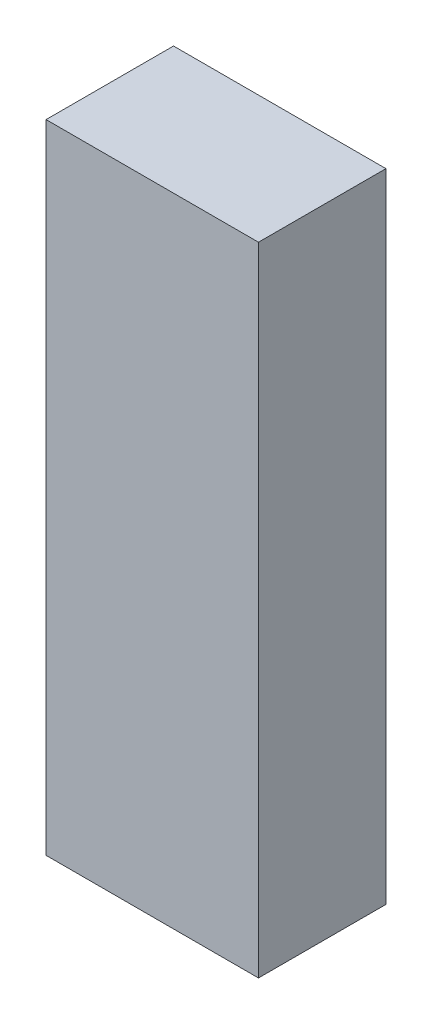
ISO-10303-21;
HEADER;
FILE_DESCRIPTION(('STEP AP214'),'2;1');
FILE_NAME('part.step','',(''),(''),'','','');
FILE_SCHEMA(('AUTOMOTIVE_DESIGN { 1 0 10303 214 1 1 1 1 }'));
ENDSEC;
DATA;
#1=APPLICATION_CONTEXT('core data for automotive mechanical design processes');
#2=APPLICATION_PROTOCOL_DEFINITION('international standard','automotive_design',2000,#1);
#3=PRODUCT_CONTEXT('',#1,'mechanical');
#4=PRODUCT('Part','Part','',(#3));
#5=PRODUCT_RELATED_PRODUCT_CATEGORY('part','',(#4));
#6=PRODUCT_DEFINITION_FORMATION('','',#4);
#7=PRODUCT_DEFINITION_CONTEXT('part definition',#1,'design');
#8=PRODUCT_DEFINITION('design','',#6,#7);
#9=PRODUCT_DEFINITION_SHAPE('','',#8);
#10=(LENGTH_UNIT() NAMED_UNIT(*) SI_UNIT(.MILLI.,.METRE.));
#11=(NAMED_UNIT(*) PLANE_ANGLE_UNIT() SI_UNIT($,.RADIAN.));
#12=(NAMED_UNIT(*) SI_UNIT($,.STERADIAN.) SOLID_ANGLE_UNIT());
#13=UNCERTAINTY_MEASURE_WITH_UNIT(LENGTH_MEASURE(1.E-05),#10,'distance_accuracy_value','');
#14=(GEOMETRIC_REPRESENTATION_CONTEXT(3) GLOBAL_UNCERTAINTY_ASSIGNED_CONTEXT((#13)) GLOBAL_UNIT_ASSIGNED_CONTEXT((#10,
#11,#12)) REPRESENTATION_CONTEXT('',''));
#15=CARTESIAN_POINT('',(0.,0.,0.));
#16=DIRECTION('',(0.,0.,1.));
#17=DIRECTION('',(1.,0.,0.));
#18=AXIS2_PLACEMENT_3D('',#15,#16,#17);
#19=CARTESIAN_POINT('',(-23.8023952095809,36.377245508982,30.));
#20=DIRECTION('',(1.,0.,0.));
#21=DIRECTION('',(0.,0.,-1.));
#22=AXIS2_PLACEMENT_3D('',#19,#20,#21);
#23=PLANE('',#22);
#24=DIRECTION('',(0.,-1.,0.));
#25=VECTOR('',#24,1.);
#26=CARTESIAN_POINT('',(-23.8023952095809,36.377245508982,0.));
#27=LINE('',#26,#25);
#28=CARTESIAN_POINT('',(-23.8023952095809,36.377245508982,0.));
#29=VERTEX_POINT('',#28);
#30=CARTESIAN_POINT('',(-23.8023952095809,-113.622754491018,0.));
#31=VERTEX_POINT('',#30);
#32=EDGE_CURVE('E104',#29,#31,#27,.T.);
#33=ORIENTED_EDGE('',*,*,#32,.T.);
#34=DIRECTION('',(0.,0.,-1.));
#35=VECTOR('',#34,1.);
#36=CARTESIAN_POINT('',(-23.8023952095809,-113.622754491018,30.));
#37=LINE('',#36,#35);
#38=CARTESIAN_POINT('',(-23.8023952095809,-113.622754491018,30.));
#39=VERTEX_POINT('',#38);
#40=EDGE_CURVE('E11',#39,#31,#37,.T.);
#41=ORIENTED_EDGE('',*,*,#40,.F.);
#42=DIRECTION('',(0.,-1.,0.));
#43=VECTOR('',#42,1.);
#44=CARTESIAN_POINT('',(-23.8023952095809,36.377245508982,30.));
#45=LINE('',#44,#43);
#46=CARTESIAN_POINT('',(-23.8023952095809,36.377245508982,30.));
#47=VERTEX_POINT('',#46);
#48=EDGE_CURVE('E92',#47,#39,#45,.T.);
#49=ORIENTED_EDGE('',*,*,#48,.F.);
#50=DIRECTION('',(0.,0.,-1.));
#51=VECTOR('',#50,1.);
#52=CARTESIAN_POINT('',(-23.8023952095809,36.377245508982,30.));
#53=LINE('',#52,#51);
#54=EDGE_CURVE('E100',#47,#29,#53,.T.);
#55=ORIENTED_EDGE('',*,*,#54,.T.);
#56=EDGE_LOOP('',(#33,#41,#49,#55));
#57=FACE_BOUND('',#56,.T.);
#58=ADVANCED_FACE('F41',(#57),#23,.F.);
#59=CARTESIAN_POINT('',(-23.8023952095809,-113.622754491018,30.));
#60=DIRECTION('',(0.,1.,0.));
#61=DIRECTION('',(-1.,0.,0.));
#62=AXIS2_PLACEMENT_3D('',#59,#60,#61);
#63=PLANE('',#62);
#64=DIRECTION('',(1.,0.,0.));
#65=VECTOR('',#64,1.);
#66=CARTESIAN_POINT('',(-23.8023952095809,-113.622754491018,0.));
#67=LINE('',#66,#65);
#68=CARTESIAN_POINT('',(26.1976047904191,-113.622754491018,0.));
#69=VERTEX_POINT('',#68);
#70=EDGE_CURVE('E96',#31,#69,#67,.T.);
#71=ORIENTED_EDGE('',*,*,#70,.T.);
#72=DIRECTION('',(0.,0.,-1.));
#73=VECTOR('',#72,1.);
#74=CARTESIAN_POINT('',(26.1976047904191,-113.622754491018,30.));
#75=LINE('',#74,#73);
#76=CARTESIAN_POINT('',(26.1976047904191,-113.622754491018,30.));
#77=VERTEX_POINT('',#76);
#78=EDGE_CURVE('E49',#77,#69,#75,.T.);
#79=ORIENTED_EDGE('',*,*,#78,.F.);
#80=DIRECTION('',(1.,0.,0.));
#81=VECTOR('',#80,1.);
#82=CARTESIAN_POINT('',(-23.8023952095809,-113.622754491018,30.));
#83=LINE('',#82,#81);
#84=EDGE_CURVE('E87',#39,#77,#83,.T.);
#85=ORIENTED_EDGE('',*,*,#84,.F.);
#86=ORIENTED_EDGE('',*,*,#40,.T.);
#87=EDGE_LOOP('',(#71,#79,#85,#86));
#88=FACE_BOUND('',#87,.T.);
#89=ADVANCED_FACE('F95',(#88),#63,.F.);
#90=CARTESIAN_POINT('',(26.1976047904191,36.377245508982,30.));
#91=DIRECTION('',(-1.,0.,0.));
#92=DIRECTION('',(0.,-1.,0.));
#93=AXIS2_PLACEMENT_3D('',#90,#91,#92);
#94=PLANE('',#93);
#95=DIRECTION('',(0.,1.,0.));
#96=VECTOR('',#95,1.);
#97=CARTESIAN_POINT('',(26.1976047904191,36.377245508982,0.));
#98=LINE('',#97,#96);
#99=CARTESIAN_POINT('',(26.1976047904191,36.377245508982,0.));
#100=VERTEX_POINT('',#99);
#101=EDGE_CURVE('E74',#69,#100,#98,.T.);
#102=ORIENTED_EDGE('',*,*,#101,.T.);
#103=DIRECTION('',(0.,0.,-1.));
#104=VECTOR('',#103,1.);
#105=CARTESIAN_POINT('',(26.1976047904191,36.377245508982,30.));
#106=LINE('',#105,#104);
#107=CARTESIAN_POINT('',(26.1976047904191,36.377245508982,30.));
#108=VERTEX_POINT('',#107);
#109=EDGE_CURVE('E97',#108,#100,#106,.T.);
#110=ORIENTED_EDGE('',*,*,#109,.F.);
#111=DIRECTION('',(0.,1.,0.));
#112=VECTOR('',#111,1.);
#113=CARTESIAN_POINT('',(26.1976047904191,36.377245508982,30.));
#114=LINE('',#113,#112);
#115=EDGE_CURVE('E90',#77,#108,#114,.T.);
#116=ORIENTED_EDGE('',*,*,#115,.F.);
#117=ORIENTED_EDGE('',*,*,#78,.T.);
#118=EDGE_LOOP('',(#102,#110,#116,#117));
#119=FACE_BOUND('',#118,.T.);
#120=ADVANCED_FACE('F98',(#119),#94,.F.);
#121=CARTESIAN_POINT('',(-23.8023952095809,36.377245508982,30.));
#122=DIRECTION('',(0.,-1.,0.));
#123=DIRECTION('',(0.,0.,-1.));
#124=AXIS2_PLACEMENT_3D('',#121,#122,#123);
#125=PLANE('',#124);
#126=DIRECTION('',(-1.,0.,0.));
#127=VECTOR('',#126,1.);
#128=CARTESIAN_POINT('',(-23.8023952095809,36.377245508982,0.));
#129=LINE('',#128,#127);
#130=EDGE_CURVE('E80',#100,#29,#129,.T.);
#131=ORIENTED_EDGE('',*,*,#130,.T.);
#132=ORIENTED_EDGE('',*,*,#54,.F.);
#133=DIRECTION('',(-1.,0.,0.));
#134=VECTOR('',#133,1.);
#135=CARTESIAN_POINT('',(-23.8023952095809,36.377245508982,30.));
#136=LINE('',#135,#134);
#137=EDGE_CURVE('E57',#108,#47,#136,.T.);
#138=ORIENTED_EDGE('',*,*,#137,.F.);
#139=ORIENTED_EDGE('',*,*,#109,.T.);
#140=EDGE_LOOP('',(#131,#132,#138,#139));
#141=FACE_BOUND('',#140,.T.);
#142=ADVANCED_FACE('F111',(#141),#125,.F.);
#143=CARTESIAN_POINT('',(0.,0.,30.));
#144=DIRECTION('',(0.,0.,1.));
#145=DIRECTION('',(1.,0.,0.));
#146=AXIS2_PLACEMENT_3D('',#143,#144,#145);
#147=PLANE('',#146);
#148=ORIENTED_EDGE('',*,*,#48,.T.);
#149=ORIENTED_EDGE('',*,*,#84,.T.);
#150=ORIENTED_EDGE('',*,*,#115,.T.);
#151=ORIENTED_EDGE('',*,*,#137,.T.);
#152=EDGE_LOOP('',(#148,#149,#150,#151));
#153=FACE_BOUND('',#152,.T.);
#154=ADVANCED_FACE('F88',(#153),#147,.T.);
#155=CARTESIAN_POINT('',(0.,0.,0.));
#156=DIRECTION('',(0.,0.,1.));
#157=DIRECTION('',(1.,0.,0.));
#158=AXIS2_PLACEMENT_3D('',#155,#156,#157);
#159=PLANE('',#158);
#160=ORIENTED_EDGE('',*,*,#32,.F.);
#161=ORIENTED_EDGE('',*,*,#130,.F.);
#162=ORIENTED_EDGE('',*,*,#101,.F.);
#163=ORIENTED_EDGE('',*,*,#70,.F.);
#164=EDGE_LOOP('',(#160,#161,#162,#163));
#165=FACE_BOUND('',#164,.T.);
#166=ADVANCED_FACE('F114',(#165),#159,.F.);
#167=CLOSED_SHELL('',(#58,#89,#120,#142,#154,#166));
#168=MANIFOLD_SOLID_BREP('B2',#167);
#169=ADVANCED_BREP_SHAPE_REPRESENTATION('',(#18,#168),#14);
#170=SHAPE_DEFINITION_REPRESENTATION(#9,#169);
ENDSEC;
END-ISO-10303-21;
